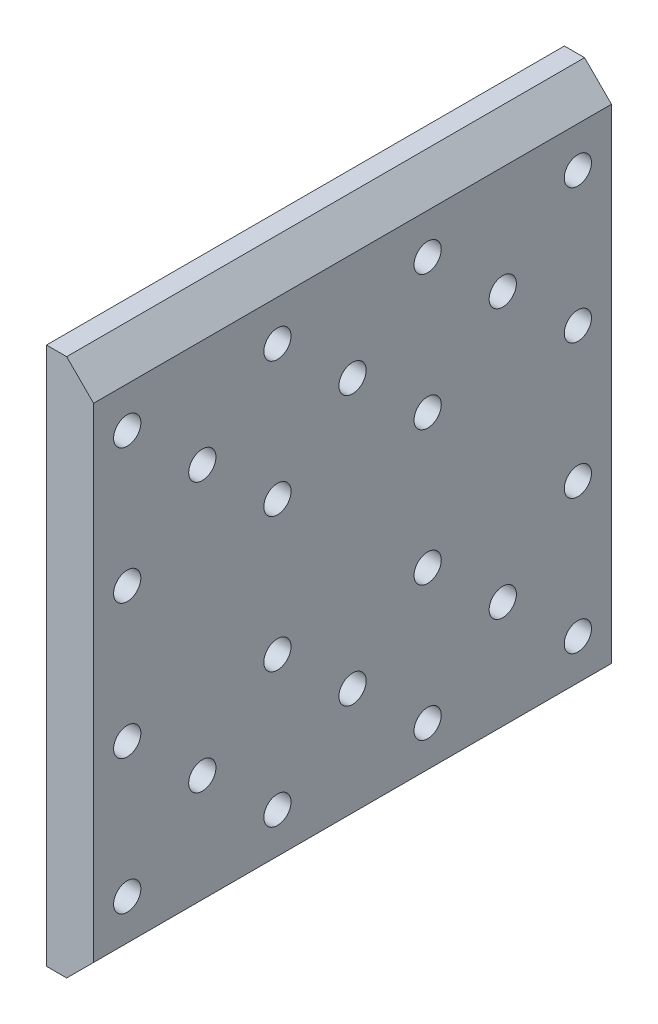
ISO-10303-21;
HEADER;
FILE_DESCRIPTION(('STEP AP214'),'2;1');
FILE_NAME('part.step','',(''),(''),'','','');
FILE_SCHEMA(('AUTOMOTIVE_DESIGN { 1 0 10303 214 1 1 1 1 }'));
ENDSEC;
DATA;
#1=APPLICATION_CONTEXT('core data for automotive mechanical design processes');
#2=APPLICATION_PROTOCOL_DEFINITION('international standard','automotive_design',2000,#1);
#3=PRODUCT_CONTEXT('',#1,'mechanical');
#4=PRODUCT('Part','Part','',(#3));
#5=PRODUCT_RELATED_PRODUCT_CATEGORY('part','',(#4));
#6=PRODUCT_DEFINITION_FORMATION('','',#4);
#7=PRODUCT_DEFINITION_CONTEXT('part definition',#1,'design');
#8=PRODUCT_DEFINITION('design','',#6,#7);
#9=PRODUCT_DEFINITION_SHAPE('','',#8);
#10=(LENGTH_UNIT() NAMED_UNIT(*) SI_UNIT(.MILLI.,.METRE.));
#11=(NAMED_UNIT(*) PLANE_ANGLE_UNIT() SI_UNIT($,.RADIAN.));
#12=(NAMED_UNIT(*) SI_UNIT($,.STERADIAN.) SOLID_ANGLE_UNIT());
#13=UNCERTAINTY_MEASURE_WITH_UNIT(LENGTH_MEASURE(1.E-05),#10,'distance_accuracy_value','');
#14=(GEOMETRIC_REPRESENTATION_CONTEXT(3) GLOBAL_UNCERTAINTY_ASSIGNED_CONTEXT((#13)) GLOBAL_UNIT_ASSIGNED_CONTEXT((#10,
#11,#12)) REPRESENTATION_CONTEXT('',''));
#15=CARTESIAN_POINT('',(0.,0.,0.));
#16=DIRECTION('',(0.,0.,1.));
#17=DIRECTION('',(1.,0.,0.));
#18=AXIS2_PLACEMENT_3D('',#15,#16,#17);
#19=CARTESIAN_POINT('',(6.5,173.75,0.));
#20=DIRECTION('',(-0.707106781186548,0.707106781186547,0.));
#21=DIRECTION('',(0.,0.,1.));
#22=AXIS2_PLACEMENT_3D('',#19,#20,#21);
#23=PLANE('',#22);
#24=DIRECTION('',(-0.707106781186547,-0.707106781186548,0.));
#25=VECTOR('',#24,1.);
#26=CARTESIAN_POINT('',(38.5,205.75,-38.5));
#27=LINE('',#26,#25);
#28=CARTESIAN_POINT('',(10.5,177.75,-38.5));
#29=VERTEX_POINT('',#28);
#30=CARTESIAN_POINT('',(6.5,173.75,-38.5));
#31=VERTEX_POINT('',#30);
#32=EDGE_CURVE('E280',#29,#31,#27,.T.);
#33=ORIENTED_EDGE('',*,*,#32,.F.);
#34=DIRECTION('',(0.,0.,-1.));
#35=VECTOR('',#34,1.);
#36=CARTESIAN_POINT('',(10.5,177.75,0.));
#37=LINE('',#36,#35);
#38=CARTESIAN_POINT('',(10.5,177.75,38.5));
#39=VERTEX_POINT('',#38);
#40=EDGE_CURVE('E386',#39,#29,#37,.T.);
#41=ORIENTED_EDGE('',*,*,#40,.F.);
#42=DIRECTION('',(0.707106781186547,0.707106781186548,0.));
#43=VECTOR('',#42,1.);
#44=CARTESIAN_POINT('',(38.5,205.75,38.5));
#45=LINE('',#44,#43);
#46=CARTESIAN_POINT('',(6.5,173.75,38.5));
#47=VERTEX_POINT('',#46);
#48=EDGE_CURVE('E329',#47,#39,#45,.T.);
#49=ORIENTED_EDGE('',*,*,#48,.F.);
#50=DIRECTION('',(0.,0.,1.));
#51=VECTOR('',#50,1.);
#52=CARTESIAN_POINT('',(6.5,173.75,0.));
#53=LINE('',#52,#51);
#54=EDGE_CURVE('E264',#31,#47,#53,.T.);
#55=ORIENTED_EDGE('',*,*,#54,.F.);
#56=EDGE_LOOP('',(#33,#41,#49,#55));
#57=FACE_BOUND('',#56,.T.);
#58=ADVANCED_FACE('F16',(#57),#23,.F.);
#59=CARTESIAN_POINT('',(10.5,249.75,0.));
#60=DIRECTION('',(0.707106781186548,0.707106781186547,0.));
#61=DIRECTION('',(0.,0.,-1.));
#62=AXIS2_PLACEMENT_3D('',#59,#60,#61);
#63=PLANE('',#62);
#64=DIRECTION('',(0.707106781186547,-0.707106781186548,0.));
#65=VECTOR('',#64,1.);
#66=CARTESIAN_POINT('',(18.5,241.75,-38.5));
#67=LINE('',#66,#65);
#68=CARTESIAN_POINT('',(6.5,253.75,-38.5));
#69=VERTEX_POINT('',#68);
#70=CARTESIAN_POINT('',(10.5,249.75,-38.5));
#71=VERTEX_POINT('',#70);
#72=EDGE_CURVE('E371',#69,#71,#67,.T.);
#73=ORIENTED_EDGE('',*,*,#72,.F.);
#74=DIRECTION('',(0.,0.,-1.));
#75=VECTOR('',#74,1.);
#76=CARTESIAN_POINT('',(6.5,253.75,-38.5));
#77=LINE('',#76,#75);
#78=CARTESIAN_POINT('',(6.5,253.75,38.5));
#79=VERTEX_POINT('',#78);
#80=EDGE_CURVE('E312',#79,#69,#77,.T.);
#81=ORIENTED_EDGE('',*,*,#80,.F.);
#82=DIRECTION('',(-0.707106781186547,0.707106781186548,0.));
#83=VECTOR('',#82,1.);
#84=CARTESIAN_POINT('',(18.5,241.75,38.5));
#85=LINE('',#84,#83);
#86=CARTESIAN_POINT('',(10.5,249.75,38.5));
#87=VERTEX_POINT('',#86);
#88=EDGE_CURVE('E294',#87,#79,#85,.T.);
#89=ORIENTED_EDGE('',*,*,#88,.F.);
#90=DIRECTION('',(0.,0.,1.));
#91=VECTOR('',#90,1.);
#92=CARTESIAN_POINT('',(10.5,249.75,38.5));
#93=LINE('',#92,#91);
#94=EDGE_CURVE('E383',#71,#87,#93,.T.);
#95=ORIENTED_EDGE('',*,*,#94,.F.);
#96=EDGE_LOOP('',(#73,#81,#89,#95));
#97=FACE_BOUND('',#96,.T.);
#98=ADVANCED_FACE('F441',(#97),#63,.T.);
#99=CARTESIAN_POINT('',(-502.267801013305,233.75,-22.3333333333334));
#100=DIRECTION('',(1.,0.,0.));
#101=DIRECTION('',(0.,0.,-1.));
#102=AXIS2_PLACEMENT_3D('',#99,#100,#101);
#103=CYLINDRICAL_SURFACE('',#102,2.025);
#104=CARTESIAN_POINT('',(3.49999999999995,233.75,-22.3333333333334));
#105=DIRECTION('',(1.,0.,0.));
#106=DIRECTION('',(0.,0.,-1.));
#107=AXIS2_PLACEMENT_3D('',#104,#105,#106);
#108=CIRCLE('',#107,2.025);
#109=CARTESIAN_POINT('',(3.49999999999995,233.75,-24.3583333333334));
#110=VERTEX_POINT('',#109);
#111=EDGE_CURVE('E546',#110,#110,#108,.T.);
#112=ORIENTED_EDGE('',*,*,#111,.F.);
#113=EDGE_LOOP('',(#112));
#114=FACE_BOUND('',#113,.T.);
#115=CARTESIAN_POINT('',(10.5,233.75,-22.3333333333334));
#116=DIRECTION('',(1.,0.,0.));
#117=DIRECTION('',(0.,0.,-1.));
#118=AXIS2_PLACEMENT_3D('',#115,#116,#117);
#119=CIRCLE('',#118,2.025);
#120=CARTESIAN_POINT('',(10.5,233.75,-24.3583333333334));
#121=VERTEX_POINT('',#120);
#122=EDGE_CURVE('E263',#121,#121,#119,.T.);
#123=ORIENTED_EDGE('',*,*,#122,.T.);
#124=EDGE_LOOP('',(#123));
#125=FACE_BOUND('',#124,.T.);
#126=ADVANCED_FACE('F18',(#114,#125),#103,.F.);
#127=CARTESIAN_POINT('',(-502.267801013305,203.75,-11.1666666666667));
#128=DIRECTION('',(1.,0.,0.));
#129=DIRECTION('',(0.,0.,-1.));
#130=AXIS2_PLACEMENT_3D('',#127,#128,#129);
#131=CYLINDRICAL_SURFACE('',#130,2.025);
#132=CARTESIAN_POINT('',(3.49999999999995,203.75,-11.1666666666667));
#133=DIRECTION('',(1.,0.,0.));
#134=DIRECTION('',(0.,0.,-1.));
#135=AXIS2_PLACEMENT_3D('',#132,#133,#134);
#136=CIRCLE('',#135,2.025);
#137=CARTESIAN_POINT('',(3.49999999999995,203.75,-13.1916666666667));
#138=VERTEX_POINT('',#137);
#139=EDGE_CURVE('E326',#138,#138,#136,.T.);
#140=ORIENTED_EDGE('',*,*,#139,.F.);
#141=EDGE_LOOP('',(#140));
#142=FACE_BOUND('',#141,.T.);
#143=CARTESIAN_POINT('',(10.5,203.75,-11.1666666666667));
#144=DIRECTION('',(1.,0.,0.));
#145=DIRECTION('',(0.,0.,-1.));
#146=AXIS2_PLACEMENT_3D('',#143,#144,#145);
#147=CIRCLE('',#146,2.025);
#148=CARTESIAN_POINT('',(10.5,203.75,-13.1916666666667));
#149=VERTEX_POINT('',#148);
#150=EDGE_CURVE('E315',#149,#149,#147,.T.);
#151=ORIENTED_EDGE('',*,*,#150,.T.);
#152=EDGE_LOOP('',(#151));
#153=FACE_BOUND('',#152,.T.);
#154=ADVANCED_FACE('F440',(#142,#153),#131,.F.);
#155=CARTESIAN_POINT('',(-502.267801013305,223.75,-11.1666666666667));
#156=DIRECTION('',(1.,0.,0.));
#157=DIRECTION('',(0.,0.,-1.));
#158=AXIS2_PLACEMENT_3D('',#155,#156,#157);
#159=CYLINDRICAL_SURFACE('',#158,2.025);
#160=CARTESIAN_POINT('',(3.49999999999995,223.75,-11.1666666666667));
#161=DIRECTION('',(1.,0.,0.));
#162=DIRECTION('',(0.,0.,-1.));
#163=AXIS2_PLACEMENT_3D('',#160,#161,#162);
#164=CIRCLE('',#163,2.025);
#165=CARTESIAN_POINT('',(3.49999999999995,223.75,-13.1916666666667));
#166=VERTEX_POINT('',#165);
#167=EDGE_CURVE('E322',#166,#166,#164,.T.);
#168=ORIENTED_EDGE('',*,*,#167,.F.);
#169=EDGE_LOOP('',(#168));
#170=FACE_BOUND('',#169,.T.);
#171=CARTESIAN_POINT('',(10.5,223.75,-11.1666666666667));
#172=DIRECTION('',(1.,0.,0.));
#173=DIRECTION('',(0.,0.,-1.));
#174=AXIS2_PLACEMENT_3D('',#171,#172,#173);
#175=CIRCLE('',#174,2.025);
#176=CARTESIAN_POINT('',(10.5,223.75,-13.1916666666667));
#177=VERTEX_POINT('',#176);
#178=EDGE_CURVE('E303',#177,#177,#175,.T.);
#179=ORIENTED_EDGE('',*,*,#178,.T.);
#180=EDGE_LOOP('',(#179));
#181=FACE_BOUND('',#180,.T.);
#182=ADVANCED_FACE('F448',(#170,#181),#159,.F.);
#183=CARTESIAN_POINT('',(-502.267801013305,243.75,11.1666666666667));
#184=DIRECTION('',(1.,0.,0.));
#185=DIRECTION('',(0.,0.,-1.));
#186=AXIS2_PLACEMENT_3D('',#183,#184,#185);
#187=CYLINDRICAL_SURFACE('',#186,2.025);
#188=CARTESIAN_POINT('',(3.49999999999995,243.75,11.1666666666667));
#189=DIRECTION('',(1.,0.,0.));
#190=DIRECTION('',(0.,0.,-1.));
#191=AXIS2_PLACEMENT_3D('',#188,#189,#190);
#192=CIRCLE('',#191,2.025);
#193=CARTESIAN_POINT('',(3.49999999999995,243.75,9.14166666666666));
#194=VERTEX_POINT('',#193);
#195=EDGE_CURVE('E325',#194,#194,#192,.T.);
#196=ORIENTED_EDGE('',*,*,#195,.F.);
#197=EDGE_LOOP('',(#196));
#198=FACE_BOUND('',#197,.T.);
#199=CARTESIAN_POINT('',(10.5,243.75,11.1666666666667));
#200=DIRECTION('',(1.,0.,0.));
#201=DIRECTION('',(0.,0.,-1.));
#202=AXIS2_PLACEMENT_3D('',#199,#200,#201);
#203=CIRCLE('',#202,2.025);
#204=CARTESIAN_POINT('',(10.5,243.75,9.14166666666666));
#205=VERTEX_POINT('',#204);
#206=EDGE_CURVE('E299',#205,#205,#203,.T.);
#207=ORIENTED_EDGE('',*,*,#206,.T.);
#208=EDGE_LOOP('',(#207));
#209=FACE_BOUND('',#208,.T.);
#210=ADVANCED_FACE('F469',(#198,#209),#187,.F.);
#211=CARTESIAN_POINT('',(-502.267801013305,183.75,11.1666666666667));
#212=DIRECTION('',(1.,0.,0.));
#213=DIRECTION('',(0.,0.,-1.));
#214=AXIS2_PLACEMENT_3D('',#211,#212,#213);
#215=CYLINDRICAL_SURFACE('',#214,2.025);
#216=CARTESIAN_POINT('',(3.49999999999995,183.75,11.1666666666667));
#217=DIRECTION('',(1.,0.,0.));
#218=DIRECTION('',(0.,0.,-1.));
#219=AXIS2_PLACEMENT_3D('',#216,#217,#218);
#220=CIRCLE('',#219,2.025);
#221=CARTESIAN_POINT('',(3.49999999999995,183.75,9.14166666666666));
#222=VERTEX_POINT('',#221);
#223=EDGE_CURVE('E561',#222,#222,#220,.T.);
#224=ORIENTED_EDGE('',*,*,#223,.F.);
#225=EDGE_LOOP('',(#224));
#226=FACE_BOUND('',#225,.T.);
#227=CARTESIAN_POINT('',(10.5,183.75,11.1666666666667));
#228=DIRECTION('',(1.,0.,0.));
#229=DIRECTION('',(0.,0.,-1.));
#230=AXIS2_PLACEMENT_3D('',#227,#228,#229);
#231=CIRCLE('',#230,2.025);
#232=CARTESIAN_POINT('',(10.5,183.75,9.14166666666666));
#233=VERTEX_POINT('',#232);
#234=EDGE_CURVE('E302',#233,#233,#231,.T.);
#235=ORIENTED_EDGE('',*,*,#234,.T.);
#236=EDGE_LOOP('',(#235));
#237=FACE_BOUND('',#236,.T.);
#238=ADVANCED_FACE('F495',(#226,#237),#215,.F.);
#239=CARTESIAN_POINT('',(-502.267801013305,233.75,0.));
#240=DIRECTION('',(1.,0.,0.));
#241=DIRECTION('',(0.,0.,-1.));
#242=AXIS2_PLACEMENT_3D('',#239,#240,#241);
#243=CYLINDRICAL_SURFACE('',#242,2.025);
#244=CARTESIAN_POINT('',(3.49999999999995,233.75,0.));
#245=DIRECTION('',(1.,0.,0.));
#246=DIRECTION('',(0.,0.,-1.));
#247=AXIS2_PLACEMENT_3D('',#244,#245,#246);
#248=CIRCLE('',#247,2.025);
#249=CARTESIAN_POINT('',(3.49999999999995,233.75,-2.025));
#250=VERTEX_POINT('',#249);
#251=EDGE_CURVE('E292',#250,#250,#248,.T.);
#252=ORIENTED_EDGE('',*,*,#251,.F.);
#253=EDGE_LOOP('',(#252));
#254=FACE_BOUND('',#253,.T.);
#255=CARTESIAN_POINT('',(10.5,233.75,0.));
#256=DIRECTION('',(1.,0.,0.));
#257=DIRECTION('',(0.,0.,-1.));
#258=AXIS2_PLACEMENT_3D('',#255,#256,#257);
#259=CIRCLE('',#258,2.025);
#260=CARTESIAN_POINT('',(10.5,233.75,-2.025));
#261=VERTEX_POINT('',#260);
#262=EDGE_CURVE('E427',#261,#261,#259,.T.);
#263=ORIENTED_EDGE('',*,*,#262,.T.);
#264=EDGE_LOOP('',(#263));
#265=FACE_BOUND('',#264,.T.);
#266=ADVANCED_FACE('F491',(#254,#265),#243,.F.);
#267=CARTESIAN_POINT('',(-502.267801013305,223.75,-33.5));
#268=DIRECTION('',(1.,0.,0.));
#269=DIRECTION('',(0.,0.,-1.));
#270=AXIS2_PLACEMENT_3D('',#267,#268,#269);
#271=CYLINDRICAL_SURFACE('',#270,2.025);
#272=CARTESIAN_POINT('',(3.49999999999995,223.75,-33.5));
#273=DIRECTION('',(1.,0.,0.));
#274=DIRECTION('',(0.,0.,-1.));
#275=AXIS2_PLACEMENT_3D('',#272,#273,#274);
#276=CIRCLE('',#275,2.025);
#277=CARTESIAN_POINT('',(3.49999999999995,223.75,-35.525));
#278=VERTEX_POINT('',#277);
#279=EDGE_CURVE('E318',#278,#278,#276,.T.);
#280=ORIENTED_EDGE('',*,*,#279,.F.);
#281=EDGE_LOOP('',(#280));
#282=FACE_BOUND('',#281,.T.);
#283=CARTESIAN_POINT('',(10.5,223.75,-33.5));
#284=DIRECTION('',(1.,0.,0.));
#285=DIRECTION('',(0.,0.,-1.));
#286=AXIS2_PLACEMENT_3D('',#283,#284,#285);
#287=CIRCLE('',#286,2.025);
#288=CARTESIAN_POINT('',(10.5,223.75,-35.525));
#289=VERTEX_POINT('',#288);
#290=EDGE_CURVE('E424',#289,#289,#287,.T.);
#291=ORIENTED_EDGE('',*,*,#290,.T.);
#292=EDGE_LOOP('',(#291));
#293=FACE_BOUND('',#292,.T.);
#294=ADVANCED_FACE('F494',(#282,#293),#271,.F.);
#295=CARTESIAN_POINT('',(-502.267801013305,193.75,-22.3333333333334));
#296=DIRECTION('',(1.,0.,0.));
#297=DIRECTION('',(0.,0.,-1.));
#298=AXIS2_PLACEMENT_3D('',#295,#296,#297);
#299=CYLINDRICAL_SURFACE('',#298,2.025);
#300=CARTESIAN_POINT('',(3.49999999999995,193.75,-22.3333333333334));
#301=DIRECTION('',(1.,0.,0.));
#302=DIRECTION('',(0.,0.,-1.));
#303=AXIS2_PLACEMENT_3D('',#300,#301,#302);
#304=CIRCLE('',#303,2.025);
#305=CARTESIAN_POINT('',(3.49999999999995,193.75,-24.3583333333334));
#306=VERTEX_POINT('',#305);
#307=EDGE_CURVE('E321',#306,#306,#304,.T.);
#308=ORIENTED_EDGE('',*,*,#307,.F.);
#309=EDGE_LOOP('',(#308));
#310=FACE_BOUND('',#309,.T.);
#311=CARTESIAN_POINT('',(10.5,193.75,-22.3333333333334));
#312=DIRECTION('',(1.,0.,0.));
#313=DIRECTION('',(0.,0.,-1.));
#314=AXIS2_PLACEMENT_3D('',#311,#312,#313);
#315=CIRCLE('',#314,2.025);
#316=CARTESIAN_POINT('',(10.5,193.75,-24.3583333333334));
#317=VERTEX_POINT('',#316);
#318=EDGE_CURVE('E338',#317,#317,#315,.T.);
#319=ORIENTED_EDGE('',*,*,#318,.T.);
#320=EDGE_LOOP('',(#319));
#321=FACE_BOUND('',#320,.T.);
#322=ADVANCED_FACE('F515',(#310,#321),#299,.F.);
#323=CARTESIAN_POINT('',(-502.267801013305,223.75,33.5));
#324=DIRECTION('',(1.,0.,0.));
#325=DIRECTION('',(0.,0.,-1.));
#326=AXIS2_PLACEMENT_3D('',#323,#324,#325);
#327=CYLINDRICAL_SURFACE('',#326,2.025);
#328=CARTESIAN_POINT('',(3.49999999999995,223.75,33.5));
#329=DIRECTION('',(1.,0.,0.));
#330=DIRECTION('',(0.,0.,-1.));
#331=AXIS2_PLACEMENT_3D('',#328,#329,#330);
#332=CIRCLE('',#331,2.025);
#333=CARTESIAN_POINT('',(3.49999999999995,223.75,31.475));
#334=VERTEX_POINT('',#333);
#335=EDGE_CURVE('E393',#334,#334,#332,.T.);
#336=ORIENTED_EDGE('',*,*,#335,.F.);
#337=EDGE_LOOP('',(#336));
#338=FACE_BOUND('',#337,.T.);
#339=CARTESIAN_POINT('',(10.5,223.75,33.5));
#340=DIRECTION('',(1.,0.,0.));
#341=DIRECTION('',(0.,0.,-1.));
#342=AXIS2_PLACEMENT_3D('',#339,#340,#341);
#343=CIRCLE('',#342,2.025);
#344=CARTESIAN_POINT('',(10.5,223.75,31.475));
#345=VERTEX_POINT('',#344);
#346=EDGE_CURVE('E334',#345,#345,#343,.T.);
#347=ORIENTED_EDGE('',*,*,#346,.T.);
#348=EDGE_LOOP('',(#347));
#349=FACE_BOUND('',#348,.T.);
#350=ADVANCED_FACE('F509',(#338,#349),#327,.F.);
#351=CARTESIAN_POINT('',(-502.267801013305,193.75,22.3333333333334));
#352=DIRECTION('',(1.,0.,0.));
#353=DIRECTION('',(0.,0.,-1.));
#354=AXIS2_PLACEMENT_3D('',#351,#352,#353);
#355=CYLINDRICAL_SURFACE('',#354,2.025);
#356=CARTESIAN_POINT('',(3.49999999999995,193.75,22.3333333333334));
#357=DIRECTION('',(1.,0.,0.));
#358=DIRECTION('',(0.,0.,-1.));
#359=AXIS2_PLACEMENT_3D('',#356,#357,#358);
#360=CIRCLE('',#359,2.025);
#361=CARTESIAN_POINT('',(3.49999999999995,193.75,20.3083333333334));
#362=VERTEX_POINT('',#361);
#363=EDGE_CURVE('E366',#362,#362,#360,.T.);
#364=ORIENTED_EDGE('',*,*,#363,.F.);
#365=EDGE_LOOP('',(#364));
#366=FACE_BOUND('',#365,.T.);
#367=CARTESIAN_POINT('',(10.5,193.75,22.3333333333334));
#368=DIRECTION('',(1.,0.,0.));
#369=DIRECTION('',(0.,0.,-1.));
#370=AXIS2_PLACEMENT_3D('',#367,#368,#369);
#371=CIRCLE('',#370,2.025);
#372=CARTESIAN_POINT('',(10.5,193.75,20.3083333333334));
#373=VERTEX_POINT('',#372);
#374=EDGE_CURVE('E337',#373,#373,#371,.T.);
#375=ORIENTED_EDGE('',*,*,#374,.T.);
#376=EDGE_LOOP('',(#375));
#377=FACE_BOUND('',#376,.T.);
#378=ADVANCED_FACE('F506',(#366,#377),#355,.F.);
#379=CARTESIAN_POINT('',(-502.267801013305,243.75,-33.5));
#380=DIRECTION('',(1.,0.,0.));
#381=DIRECTION('',(0.,0.,-1.));
#382=AXIS2_PLACEMENT_3D('',#379,#380,#381);
#383=CYLINDRICAL_SURFACE('',#382,2.025);
#384=CARTESIAN_POINT('',(3.49999999999995,243.75,-33.5));
#385=DIRECTION('',(1.,0.,0.));
#386=DIRECTION('',(0.,0.,-1.));
#387=AXIS2_PLACEMENT_3D('',#384,#385,#386);
#388=CIRCLE('',#387,2.025);
#389=CARTESIAN_POINT('',(3.49999999999995,243.75,-35.525));
#390=VERTEX_POINT('',#389);
#391=EDGE_CURVE('E363',#390,#390,#388,.T.);
#392=ORIENTED_EDGE('',*,*,#391,.F.);
#393=EDGE_LOOP('',(#392));
#394=FACE_BOUND('',#393,.T.);
#395=CARTESIAN_POINT('',(10.5,243.75,-33.5));
#396=DIRECTION('',(1.,0.,0.));
#397=DIRECTION('',(0.,0.,-1.));
#398=AXIS2_PLACEMENT_3D('',#395,#396,#397);
#399=CIRCLE('',#398,2.025);
#400=CARTESIAN_POINT('',(10.5,243.75,-35.525));
#401=VERTEX_POINT('',#400);
#402=EDGE_CURVE('E347',#401,#401,#399,.T.);
#403=ORIENTED_EDGE('',*,*,#402,.T.);
#404=EDGE_LOOP('',(#403));
#405=FACE_BOUND('',#404,.T.);
#406=ADVANCED_FACE('F405',(#394,#405),#383,.F.);
#407=CARTESIAN_POINT('',(-502.267801013305,203.75,11.1666666666667));
#408=DIRECTION('',(1.,0.,0.));
#409=DIRECTION('',(0.,0.,-1.));
#410=AXIS2_PLACEMENT_3D('',#407,#408,#409);
#411=CYLINDRICAL_SURFACE('',#410,2.025);
#412=CARTESIAN_POINT('',(3.49999999999995,203.75,11.1666666666667));
#413=DIRECTION('',(1.,0.,0.));
#414=DIRECTION('',(0.,0.,-1.));
#415=AXIS2_PLACEMENT_3D('',#412,#413,#414);
#416=CIRCLE('',#415,2.025);
#417=CARTESIAN_POINT('',(3.49999999999995,203.75,9.14166666666666));
#418=VERTEX_POINT('',#417);
#419=EDGE_CURVE('E333',#418,#418,#416,.T.);
#420=ORIENTED_EDGE('',*,*,#419,.F.);
#421=EDGE_LOOP('',(#420));
#422=FACE_BOUND('',#421,.T.);
#423=CARTESIAN_POINT('',(10.5,203.75,11.1666666666667));
#424=DIRECTION('',(1.,0.,0.));
#425=DIRECTION('',(0.,0.,-1.));
#426=AXIS2_PLACEMENT_3D('',#423,#424,#425);
#427=CIRCLE('',#426,2.025);
#428=CARTESIAN_POINT('',(10.5,203.75,9.14166666666666));
#429=VERTEX_POINT('',#428);
#430=EDGE_CURVE('E342',#429,#429,#427,.T.);
#431=ORIENTED_EDGE('',*,*,#430,.T.);
#432=EDGE_LOOP('',(#431));
#433=FACE_BOUND('',#432,.T.);
#434=ADVANCED_FACE('F401',(#422,#433),#411,.F.);
#435=CARTESIAN_POINT('',(-502.267801013305,233.75,22.3333333333334));
#436=DIRECTION('',(1.,0.,0.));
#437=DIRECTION('',(0.,0.,-1.));
#438=AXIS2_PLACEMENT_3D('',#435,#436,#437);
#439=CYLINDRICAL_SURFACE('',#438,2.025);
#440=CARTESIAN_POINT('',(3.49999999999995,233.75,22.3333333333334));
#441=DIRECTION('',(1.,0.,0.));
#442=DIRECTION('',(0.,0.,-1.));
#443=AXIS2_PLACEMENT_3D('',#440,#441,#442);
#444=CIRCLE('',#443,2.025);
#445=CARTESIAN_POINT('',(3.49999999999995,233.75,20.3083333333334));
#446=VERTEX_POINT('',#445);
#447=EDGE_CURVE('E330',#446,#446,#444,.T.);
#448=ORIENTED_EDGE('',*,*,#447,.F.);
#449=EDGE_LOOP('',(#448));
#450=FACE_BOUND('',#449,.T.);
#451=CARTESIAN_POINT('',(10.5,233.75,22.3333333333334));
#452=DIRECTION('',(1.,0.,0.));
#453=DIRECTION('',(0.,0.,-1.));
#454=AXIS2_PLACEMENT_3D('',#451,#452,#453);
#455=CIRCLE('',#454,2.025);
#456=CARTESIAN_POINT('',(10.5,233.75,20.3083333333334));
#457=VERTEX_POINT('',#456);
#458=EDGE_CURVE('E346',#457,#457,#455,.T.);
#459=ORIENTED_EDGE('',*,*,#458,.T.);
#460=EDGE_LOOP('',(#459));
#461=FACE_BOUND('',#460,.T.);
#462=ADVANCED_FACE('F404',(#450,#461),#439,.F.);
#463=CARTESIAN_POINT('',(-502.267801013305,203.75,33.5));
#464=DIRECTION('',(1.,0.,0.));
#465=DIRECTION('',(0.,0.,-1.));
#466=AXIS2_PLACEMENT_3D('',#463,#464,#465);
#467=CYLINDRICAL_SURFACE('',#466,2.025);
#468=CARTESIAN_POINT('',(3.49999999999995,203.75,33.5));
#469=DIRECTION('',(1.,0.,0.));
#470=DIRECTION('',(0.,0.,-1.));
#471=AXIS2_PLACEMENT_3D('',#468,#469,#470);
#472=CIRCLE('',#471,2.025);
#473=CARTESIAN_POINT('',(3.49999999999995,203.75,31.475));
#474=VERTEX_POINT('',#473);
#475=EDGE_CURVE('E20',#474,#474,#472,.T.);
#476=ORIENTED_EDGE('',*,*,#475,.F.);
#477=EDGE_LOOP('',(#476));
#478=FACE_BOUND('',#477,.T.);
#479=CARTESIAN_POINT('',(10.5,203.75,33.5));
#480=DIRECTION('',(1.,0.,0.));
#481=DIRECTION('',(0.,0.,-1.));
#482=AXIS2_PLACEMENT_3D('',#479,#480,#481);
#483=CIRCLE('',#482,2.025);
#484=CARTESIAN_POINT('',(10.5,203.75,31.475));
#485=VERTEX_POINT('',#484);
#486=EDGE_CURVE('E351',#485,#485,#483,.T.);
#487=ORIENTED_EDGE('',*,*,#486,.T.);
#488=EDGE_LOOP('',(#487));
#489=FACE_BOUND('',#488,.T.);
#490=ADVANCED_FACE('F477',(#478,#489),#467,.F.);
#491=CARTESIAN_POINT('',(-502.267801013305,183.75,33.5));
#492=DIRECTION('',(1.,0.,0.));
#493=DIRECTION('',(0.,0.,-1.));
#494=AXIS2_PLACEMENT_3D('',#491,#492,#493);
#495=CYLINDRICAL_SURFACE('',#494,2.025);
#496=CARTESIAN_POINT('',(3.49999999999995,183.75,33.5));
#497=DIRECTION('',(1.,0.,0.));
#498=DIRECTION('',(0.,0.,-1.));
#499=AXIS2_PLACEMENT_3D('',#496,#497,#498);
#500=CIRCLE('',#499,2.025);
#501=CARTESIAN_POINT('',(3.49999999999995,183.75,31.475));
#502=VERTEX_POINT('',#501);
#503=EDGE_CURVE('E213',#502,#502,#500,.T.);
#504=ORIENTED_EDGE('',*,*,#503,.F.);
#505=EDGE_LOOP('',(#504));
#506=FACE_BOUND('',#505,.T.);
#507=CARTESIAN_POINT('',(10.5,183.75,33.5));
#508=DIRECTION('',(1.,0.,0.));
#509=DIRECTION('',(0.,0.,-1.));
#510=AXIS2_PLACEMENT_3D('',#507,#508,#509);
#511=CIRCLE('',#510,2.025);
#512=CARTESIAN_POINT('',(10.5,183.75,31.475));
#513=VERTEX_POINT('',#512);
#514=EDGE_CURVE('E348',#513,#513,#511,.T.);
#515=ORIENTED_EDGE('',*,*,#514,.T.);
#516=EDGE_LOOP('',(#515));
#517=FACE_BOUND('',#516,.T.);
#518=ADVANCED_FACE('F479',(#506,#517),#495,.F.);
#519=CARTESIAN_POINT('',(-502.267801013305,243.75,-11.1666666666667));
#520=DIRECTION('',(1.,0.,0.));
#521=DIRECTION('',(0.,0.,-1.));
#522=AXIS2_PLACEMENT_3D('',#519,#520,#521);
#523=CYLINDRICAL_SURFACE('',#522,2.025);
#524=CARTESIAN_POINT('',(3.49999999999995,243.75,-11.1666666666667));
#525=DIRECTION('',(1.,0.,0.));
#526=DIRECTION('',(0.,0.,-1.));
#527=AXIS2_PLACEMENT_3D('',#524,#525,#526);
#528=CIRCLE('',#527,2.025);
#529=CARTESIAN_POINT('',(3.49999999999995,243.75,-13.1916666666667));
#530=VERTEX_POINT('',#529);
#531=EDGE_CURVE('E222',#530,#530,#528,.T.);
#532=ORIENTED_EDGE('',*,*,#531,.F.);
#533=EDGE_LOOP('',(#532));
#534=FACE_BOUND('',#533,.T.);
#535=CARTESIAN_POINT('',(10.5,243.75,-11.1666666666667));
#536=DIRECTION('',(1.,0.,0.));
#537=DIRECTION('',(0.,0.,-1.));
#538=AXIS2_PLACEMENT_3D('',#535,#536,#537);
#539=CIRCLE('',#538,2.025);
#540=CARTESIAN_POINT('',(10.5,243.75,-13.1916666666667));
#541=VERTEX_POINT('',#540);
#542=EDGE_CURVE('E308',#541,#541,#539,.T.);
#543=ORIENTED_EDGE('',*,*,#542,.T.);
#544=EDGE_LOOP('',(#543));
#545=FACE_BOUND('',#544,.T.);
#546=ADVANCED_FACE('F465',(#534,#545),#523,.F.);
#547=CARTESIAN_POINT('',(-502.267801013305,183.75,-11.1666666666667));
#548=DIRECTION('',(1.,0.,0.));
#549=DIRECTION('',(0.,0.,-1.));
#550=AXIS2_PLACEMENT_3D('',#547,#548,#549);
#551=CYLINDRICAL_SURFACE('',#550,2.025);
#552=CARTESIAN_POINT('',(3.49999999999995,183.75,-11.1666666666667));
#553=DIRECTION('',(1.,0.,0.));
#554=DIRECTION('',(0.,0.,-1.));
#555=AXIS2_PLACEMENT_3D('',#552,#553,#554);
#556=CIRCLE('',#555,2.025);
#557=CARTESIAN_POINT('',(3.49999999999995,183.75,-13.1916666666667));
#558=VERTEX_POINT('',#557);
#559=EDGE_CURVE('E359',#558,#558,#556,.T.);
#560=ORIENTED_EDGE('',*,*,#559,.F.);
#561=EDGE_LOOP('',(#560));
#562=FACE_BOUND('',#561,.T.);
#563=CARTESIAN_POINT('',(10.5,183.75,-11.1666666666667));
#564=DIRECTION('',(1.,0.,0.));
#565=DIRECTION('',(0.,0.,-1.));
#566=AXIS2_PLACEMENT_3D('',#563,#564,#565);
#567=CIRCLE('',#566,2.025);
#568=CARTESIAN_POINT('',(10.5,183.75,-13.1916666666667));
#569=VERTEX_POINT('',#568);
#570=EDGE_CURVE('E304',#569,#569,#567,.T.);
#571=ORIENTED_EDGE('',*,*,#570,.T.);
#572=EDGE_LOOP('',(#571));
#573=FACE_BOUND('',#572,.T.);
#574=ADVANCED_FACE('F461',(#562,#573),#551,.F.);
#575=CARTESIAN_POINT('',(-502.267801013305,193.75,0.));
#576=DIRECTION('',(1.,0.,0.));
#577=DIRECTION('',(0.,0.,-1.));
#578=AXIS2_PLACEMENT_3D('',#575,#576,#577);
#579=CYLINDRICAL_SURFACE('',#578,2.025);
#580=CARTESIAN_POINT('',(3.49999999999995,193.75,0.));
#581=DIRECTION('',(1.,0.,0.));
#582=DIRECTION('',(0.,0.,-1.));
#583=AXIS2_PLACEMENT_3D('',#580,#581,#582);
#584=CIRCLE('',#583,2.025);
#585=CARTESIAN_POINT('',(3.49999999999995,193.75,-2.025));
#586=VERTEX_POINT('',#585);
#587=EDGE_CURVE('E355',#586,#586,#584,.T.);
#588=ORIENTED_EDGE('',*,*,#587,.F.);
#589=EDGE_LOOP('',(#588));
#590=FACE_BOUND('',#589,.T.);
#591=CARTESIAN_POINT('',(10.5,193.75,0.));
#592=DIRECTION('',(1.,0.,0.));
#593=DIRECTION('',(0.,0.,-1.));
#594=AXIS2_PLACEMENT_3D('',#591,#592,#593);
#595=CIRCLE('',#594,2.025);
#596=CARTESIAN_POINT('',(10.5,193.75,-2.025));
#597=VERTEX_POINT('',#596);
#598=EDGE_CURVE('E307',#597,#597,#595,.T.);
#599=ORIENTED_EDGE('',*,*,#598,.T.);
#600=EDGE_LOOP('',(#599));
#601=FACE_BOUND('',#600,.T.);
#602=ADVANCED_FACE('F464',(#590,#601),#579,.F.);
#603=CARTESIAN_POINT('',(-502.267801013305,223.75,11.1666666666667));
#604=DIRECTION('',(1.,0.,0.));
#605=DIRECTION('',(0.,0.,-1.));
#606=AXIS2_PLACEMENT_3D('',#603,#604,#605);
#607=CYLINDRICAL_SURFACE('',#606,2.025);
#608=CARTESIAN_POINT('',(3.49999999999995,223.75,11.1666666666667));
#609=DIRECTION('',(1.,0.,0.));
#610=DIRECTION('',(0.,0.,-1.));
#611=AXIS2_PLACEMENT_3D('',#608,#609,#610);
#612=CIRCLE('',#611,2.025);
#613=CARTESIAN_POINT('',(3.49999999999995,223.75,9.14166666666666));
#614=VERTEX_POINT('',#613);
#615=EDGE_CURVE('E358',#614,#614,#612,.T.);
#616=ORIENTED_EDGE('',*,*,#615,.F.);
#617=EDGE_LOOP('',(#616));
#618=FACE_BOUND('',#617,.T.);
#619=CARTESIAN_POINT('',(10.5,223.75,11.1666666666667));
#620=DIRECTION('',(1.,0.,0.));
#621=DIRECTION('',(0.,0.,-1.));
#622=AXIS2_PLACEMENT_3D('',#619,#620,#621);
#623=CIRCLE('',#622,2.025);
#624=CARTESIAN_POINT('',(10.5,223.75,9.14166666666666));
#625=VERTEX_POINT('',#624);
#626=EDGE_CURVE('E354',#625,#625,#623,.T.);
#627=ORIENTED_EDGE('',*,*,#626,.T.);
#628=EDGE_LOOP('',(#627));
#629=FACE_BOUND('',#628,.T.);
#630=ADVANCED_FACE('F473',(#618,#629),#607,.F.);
#631=CARTESIAN_POINT('',(-502.267801013305,183.75,-33.5));
#632=DIRECTION('',(1.,0.,0.));
#633=DIRECTION('',(0.,0.,-1.));
#634=AXIS2_PLACEMENT_3D('',#631,#632,#633);
#635=CYLINDRICAL_SURFACE('',#634,2.025);
#636=CARTESIAN_POINT('',(3.49999999999995,183.75,-33.5));
#637=DIRECTION('',(1.,0.,0.));
#638=DIRECTION('',(0.,0.,-1.));
#639=AXIS2_PLACEMENT_3D('',#636,#637,#638);
#640=CIRCLE('',#639,2.025);
#641=CARTESIAN_POINT('',(3.49999999999995,183.75,-35.525));
#642=VERTEX_POINT('',#641);
#643=EDGE_CURVE('E535',#642,#642,#640,.T.);
#644=ORIENTED_EDGE('',*,*,#643,.F.);
#645=EDGE_LOOP('',(#644));
#646=FACE_BOUND('',#645,.T.);
#647=CARTESIAN_POINT('',(10.5,183.75,-33.5));
#648=DIRECTION('',(1.,0.,0.));
#649=DIRECTION('',(0.,0.,-1.));
#650=AXIS2_PLACEMENT_3D('',#647,#648,#649);
#651=CIRCLE('',#650,2.025);
#652=CARTESIAN_POINT('',(10.5,183.75,-35.525));
#653=VERTEX_POINT('',#652);
#654=EDGE_CURVE('E382',#653,#653,#651,.T.);
#655=ORIENTED_EDGE('',*,*,#654,.T.);
#656=EDGE_LOOP('',(#655));
#657=FACE_BOUND('',#656,.T.);
#658=ADVANCED_FACE('F522',(#646,#657),#635,.F.);
#659=CARTESIAN_POINT('',(-502.267801013305,203.75,-33.5));
#660=DIRECTION('',(1.,0.,0.));
#661=DIRECTION('',(0.,0.,-1.));
#662=AXIS2_PLACEMENT_3D('',#659,#660,#661);
#663=CYLINDRICAL_SURFACE('',#662,2.025);
#664=CARTESIAN_POINT('',(3.49999999999995,203.75,-33.5));
#665=DIRECTION('',(1.,0.,0.));
#666=DIRECTION('',(0.,0.,-1.));
#667=AXIS2_PLACEMENT_3D('',#664,#665,#666);
#668=CIRCLE('',#667,2.025);
#669=CARTESIAN_POINT('',(3.49999999999995,203.75,-35.525));
#670=VERTEX_POINT('',#669);
#671=EDGE_CURVE('E27',#670,#670,#668,.T.);
#672=ORIENTED_EDGE('',*,*,#671,.F.);
#673=EDGE_LOOP('',(#672));
#674=FACE_BOUND('',#673,.T.);
#675=CARTESIAN_POINT('',(10.5,203.75,-33.5));
#676=DIRECTION('',(1.,0.,0.));
#677=DIRECTION('',(0.,0.,-1.));
#678=AXIS2_PLACEMENT_3D('',#675,#676,#677);
#679=CIRCLE('',#678,2.025);
#680=CARTESIAN_POINT('',(10.5,203.75,-35.525));
#681=VERTEX_POINT('',#680);
#682=EDGE_CURVE('E377',#681,#681,#679,.T.);
#683=ORIENTED_EDGE('',*,*,#682,.T.);
#684=EDGE_LOOP('',(#683));
#685=FACE_BOUND('',#684,.T.);
#686=ADVANCED_FACE('F488',(#674,#685),#663,.F.);
#687=CARTESIAN_POINT('',(-502.267801013305,243.75,33.5));
#688=DIRECTION('',(1.,0.,0.));
#689=DIRECTION('',(0.,0.,-1.));
#690=AXIS2_PLACEMENT_3D('',#687,#688,#689);
#691=CYLINDRICAL_SURFACE('',#690,2.025);
#692=CARTESIAN_POINT('',(3.49999999999995,243.75,33.5));
#693=DIRECTION('',(1.,0.,0.));
#694=DIRECTION('',(0.,0.,-1.));
#695=AXIS2_PLACEMENT_3D('',#692,#693,#694);
#696=CIRCLE('',#695,2.025);
#697=CARTESIAN_POINT('',(3.49999999999995,243.75,31.475));
#698=VERTEX_POINT('',#697);
#699=EDGE_CURVE('E11',#698,#698,#696,.T.);
#700=ORIENTED_EDGE('',*,*,#699,.F.);
#701=EDGE_LOOP('',(#700));
#702=FACE_BOUND('',#701,.T.);
#703=CARTESIAN_POINT('',(10.5,243.75,33.5));
#704=DIRECTION('',(1.,0.,0.));
#705=DIRECTION('',(0.,0.,-1.));
#706=AXIS2_PLACEMENT_3D('',#703,#704,#705);
#707=CIRCLE('',#706,2.025);
#708=CARTESIAN_POINT('',(10.5,243.75,31.475));
#709=VERTEX_POINT('',#708);
#710=EDGE_CURVE('E381',#709,#709,#707,.T.);
#711=ORIENTED_EDGE('',*,*,#710,.T.);
#712=EDGE_LOOP('',(#711));
#713=FACE_BOUND('',#712,.T.);
#714=ADVANCED_FACE('F486',(#702,#713),#691,.F.);
#715=CARTESIAN_POINT('',(3.5,214.875,0.));
#716=DIRECTION('',(1.,0.,0.));
#717=DIRECTION('',(0.,1.,0.));
#718=AXIS2_PLACEMENT_3D('',#715,#716,#717);
#719=PLANE('',#718);
#720=DIRECTION('',(0.,-1.,0.));
#721=VECTOR('',#720,1.);
#722=CARTESIAN_POINT('',(3.5,233.75,-38.5));
#723=LINE('',#722,#721);
#724=CARTESIAN_POINT('',(3.5,253.75,-38.5));
#725=VERTEX_POINT('',#724);
#726=CARTESIAN_POINT('',(3.5,173.75,-38.5));
#727=VERTEX_POINT('',#726);
#728=EDGE_CURVE('E267',#725,#727,#723,.T.);
#729=ORIENTED_EDGE('',*,*,#728,.T.);
#730=DIRECTION('',(0.,0.,1.));
#731=VECTOR('',#730,1.);
#732=CARTESIAN_POINT('',(3.5,173.75,0.));
#733=LINE('',#732,#731);
#734=CARTESIAN_POINT('',(3.5,173.75,38.5));
#735=VERTEX_POINT('',#734);
#736=EDGE_CURVE('E252',#727,#735,#733,.T.);
#737=ORIENTED_EDGE('',*,*,#736,.T.);
#738=DIRECTION('',(0.,1.,0.));
#739=VECTOR('',#738,1.);
#740=CARTESIAN_POINT('',(3.5,233.75,38.5));
#741=LINE('',#740,#739);
#742=CARTESIAN_POINT('',(3.5,253.75,38.5));
#743=VERTEX_POINT('',#742);
#744=EDGE_CURVE('E297',#735,#743,#741,.T.);
#745=ORIENTED_EDGE('',*,*,#744,.T.);
#746=DIRECTION('',(0.,0.,1.));
#747=VECTOR('',#746,1.);
#748=CARTESIAN_POINT('',(3.5,253.75,0.));
#749=LINE('',#748,#747);
#750=EDGE_CURVE('E270',#725,#743,#749,.T.);
#751=ORIENTED_EDGE('',*,*,#750,.F.);
#752=EDGE_LOOP('',(#729,#737,#745,#751));
#753=FACE_BOUND('',#752,.T.);
#754=ORIENTED_EDGE('',*,*,#699,.T.);
#755=EDGE_LOOP('',(#754));
#756=FACE_BOUND('',#755,.T.);
#757=ORIENTED_EDGE('',*,*,#671,.T.);
#758=EDGE_LOOP('',(#757));
#759=FACE_BOUND('',#758,.T.);
#760=ORIENTED_EDGE('',*,*,#643,.T.);
#761=EDGE_LOOP('',(#760));
#762=FACE_BOUND('',#761,.T.);
#763=ORIENTED_EDGE('',*,*,#615,.T.);
#764=EDGE_LOOP('',(#763));
#765=FACE_BOUND('',#764,.T.);
#766=ORIENTED_EDGE('',*,*,#587,.T.);
#767=EDGE_LOOP('',(#766));
#768=FACE_BOUND('',#767,.T.);
#769=ORIENTED_EDGE('',*,*,#559,.T.);
#770=EDGE_LOOP('',(#769));
#771=FACE_BOUND('',#770,.T.);
#772=ORIENTED_EDGE('',*,*,#531,.T.);
#773=EDGE_LOOP('',(#772));
#774=FACE_BOUND('',#773,.T.);
#775=ORIENTED_EDGE('',*,*,#503,.T.);
#776=EDGE_LOOP('',(#775));
#777=FACE_BOUND('',#776,.T.);
#778=ORIENTED_EDGE('',*,*,#475,.T.);
#779=EDGE_LOOP('',(#778));
#780=FACE_BOUND('',#779,.T.);
#781=ORIENTED_EDGE('',*,*,#447,.T.);
#782=EDGE_LOOP('',(#781));
#783=FACE_BOUND('',#782,.T.);
#784=ORIENTED_EDGE('',*,*,#419,.T.);
#785=EDGE_LOOP('',(#784));
#786=FACE_BOUND('',#785,.T.);
#787=ORIENTED_EDGE('',*,*,#391,.T.);
#788=EDGE_LOOP('',(#787));
#789=FACE_BOUND('',#788,.T.);
#790=ORIENTED_EDGE('',*,*,#363,.T.);
#791=EDGE_LOOP('',(#790));
#792=FACE_BOUND('',#791,.T.);
#793=ORIENTED_EDGE('',*,*,#335,.T.);
#794=EDGE_LOOP('',(#793));
#795=FACE_BOUND('',#794,.T.);
#796=ORIENTED_EDGE('',*,*,#307,.T.);
#797=EDGE_LOOP('',(#796));
#798=FACE_BOUND('',#797,.T.);
#799=ORIENTED_EDGE('',*,*,#279,.T.);
#800=EDGE_LOOP('',(#799));
#801=FACE_BOUND('',#800,.T.);
#802=ORIENTED_EDGE('',*,*,#251,.T.);
#803=EDGE_LOOP('',(#802));
#804=FACE_BOUND('',#803,.T.);
#805=ORIENTED_EDGE('',*,*,#223,.T.);
#806=EDGE_LOOP('',(#805));
#807=FACE_BOUND('',#806,.T.);
#808=ORIENTED_EDGE('',*,*,#195,.T.);
#809=EDGE_LOOP('',(#808));
#810=FACE_BOUND('',#809,.T.);
#811=ORIENTED_EDGE('',*,*,#167,.T.);
#812=EDGE_LOOP('',(#811));
#813=FACE_BOUND('',#812,.T.);
#814=ORIENTED_EDGE('',*,*,#139,.T.);
#815=EDGE_LOOP('',(#814));
#816=FACE_BOUND('',#815,.T.);
#817=ORIENTED_EDGE('',*,*,#111,.T.);
#818=EDGE_LOOP('',(#817));
#819=FACE_BOUND('',#818,.T.);
#820=ADVANCED_FACE('F268',(#753,#756,#759,#762,#765,#768,#771,#774,#777,#780,#783,#786,#789,
#792,#795,#798,#801,#804,#807,#810,#813,#816,#819),#719,.F.);
#821=CARTESIAN_POINT('',(10.5,214.875,0.));
#822=DIRECTION('',(1.,0.,0.));
#823=DIRECTION('',(0.,1.,0.));
#824=AXIS2_PLACEMENT_3D('',#821,#822,#823);
#825=PLANE('',#824);
#826=DIRECTION('',(0.,-1.,0.));
#827=VECTOR('',#826,1.);
#828=CARTESIAN_POINT('',(10.5,233.75,-38.5));
#829=LINE('',#828,#827);
#830=EDGE_CURVE('E288',#71,#29,#829,.T.);
#831=ORIENTED_EDGE('',*,*,#830,.F.);
#832=ORIENTED_EDGE('',*,*,#94,.T.);
#833=DIRECTION('',(0.,1.,0.));
#834=VECTOR('',#833,1.);
#835=CARTESIAN_POINT('',(10.5,233.75,38.5));
#836=LINE('',#835,#834);
#837=EDGE_CURVE('E298',#39,#87,#836,.T.);
#838=ORIENTED_EDGE('',*,*,#837,.F.);
#839=ORIENTED_EDGE('',*,*,#40,.T.);
#840=EDGE_LOOP('',(#831,#832,#838,#839));
#841=FACE_BOUND('',#840,.T.);
#842=ORIENTED_EDGE('',*,*,#710,.F.);
#843=EDGE_LOOP('',(#842));
#844=FACE_BOUND('',#843,.T.);
#845=ORIENTED_EDGE('',*,*,#682,.F.);
#846=EDGE_LOOP('',(#845));
#847=FACE_BOUND('',#846,.T.);
#848=ORIENTED_EDGE('',*,*,#654,.F.);
#849=EDGE_LOOP('',(#848));
#850=FACE_BOUND('',#849,.T.);
#851=ORIENTED_EDGE('',*,*,#626,.F.);
#852=EDGE_LOOP('',(#851));
#853=FACE_BOUND('',#852,.T.);
#854=ORIENTED_EDGE('',*,*,#598,.F.);
#855=EDGE_LOOP('',(#854));
#856=FACE_BOUND('',#855,.T.);
#857=ORIENTED_EDGE('',*,*,#570,.F.);
#858=EDGE_LOOP('',(#857));
#859=FACE_BOUND('',#858,.T.);
#860=ORIENTED_EDGE('',*,*,#542,.F.);
#861=EDGE_LOOP('',(#860));
#862=FACE_BOUND('',#861,.T.);
#863=ORIENTED_EDGE('',*,*,#514,.F.);
#864=EDGE_LOOP('',(#863));
#865=FACE_BOUND('',#864,.T.);
#866=ORIENTED_EDGE('',*,*,#486,.F.);
#867=EDGE_LOOP('',(#866));
#868=FACE_BOUND('',#867,.T.);
#869=ORIENTED_EDGE('',*,*,#458,.F.);
#870=EDGE_LOOP('',(#869));
#871=FACE_BOUND('',#870,.T.);
#872=ORIENTED_EDGE('',*,*,#430,.F.);
#873=EDGE_LOOP('',(#872));
#874=FACE_BOUND('',#873,.T.);
#875=ORIENTED_EDGE('',*,*,#402,.F.);
#876=EDGE_LOOP('',(#875));
#877=FACE_BOUND('',#876,.T.);
#878=ORIENTED_EDGE('',*,*,#374,.F.);
#879=EDGE_LOOP('',(#878));
#880=FACE_BOUND('',#879,.T.);
#881=ORIENTED_EDGE('',*,*,#346,.F.);
#882=EDGE_LOOP('',(#881));
#883=FACE_BOUND('',#882,.T.);
#884=ORIENTED_EDGE('',*,*,#318,.F.);
#885=EDGE_LOOP('',(#884));
#886=FACE_BOUND('',#885,.T.);
#887=ORIENTED_EDGE('',*,*,#290,.F.);
#888=EDGE_LOOP('',(#887));
#889=FACE_BOUND('',#888,.T.);
#890=ORIENTED_EDGE('',*,*,#262,.F.);
#891=EDGE_LOOP('',(#890));
#892=FACE_BOUND('',#891,.T.);
#893=ORIENTED_EDGE('',*,*,#234,.F.);
#894=EDGE_LOOP('',(#893));
#895=FACE_BOUND('',#894,.T.);
#896=ORIENTED_EDGE('',*,*,#206,.F.);
#897=EDGE_LOOP('',(#896));
#898=FACE_BOUND('',#897,.T.);
#899=ORIENTED_EDGE('',*,*,#178,.F.);
#900=EDGE_LOOP('',(#899));
#901=FACE_BOUND('',#900,.T.);
#902=ORIENTED_EDGE('',*,*,#150,.F.);
#903=EDGE_LOOP('',(#902));
#904=FACE_BOUND('',#903,.T.);
#905=ORIENTED_EDGE('',*,*,#122,.F.);
#906=EDGE_LOOP('',(#905));
#907=FACE_BOUND('',#906,.T.);
#908=ADVANCED_FACE('F409',(#841,#844,#847,#850,#853,#856,#859,#862,#865,#868,#871,#874,#877,
#880,#883,#886,#889,#892,#895,#898,#901,#904,#907),#825,.T.);
#909=CARTESIAN_POINT('',(10.5,173.75,0.));
#910=DIRECTION('',(0.,-1.,0.));
#911=DIRECTION('',(0.,0.,-1.));
#912=AXIS2_PLACEMENT_3D('',#909,#910,#911);
#913=PLANE('',#912);
#914=DIRECTION('',(-1.,0.,0.));
#915=VECTOR('',#914,1.);
#916=CARTESIAN_POINT('',(10.5,173.75,-38.5));
#917=LINE('',#916,#915);
#918=EDGE_CURVE('E256',#31,#727,#917,.T.);
#919=ORIENTED_EDGE('',*,*,#918,.F.);
#920=ORIENTED_EDGE('',*,*,#54,.T.);
#921=DIRECTION('',(-1.,0.,0.));
#922=VECTOR('',#921,1.);
#923=CARTESIAN_POINT('',(10.5,173.75,38.5));
#924=LINE('',#923,#922);
#925=EDGE_CURVE('E259',#47,#735,#924,.T.);
#926=ORIENTED_EDGE('',*,*,#925,.T.);
#927=ORIENTED_EDGE('',*,*,#736,.F.);
#928=EDGE_LOOP('',(#919,#920,#926,#927));
#929=FACE_BOUND('',#928,.T.);
#930=ADVANCED_FACE('F254',(#929),#913,.T.);
#931=CARTESIAN_POINT('',(10.5,233.75,38.5));
#932=DIRECTION('',(0.,0.,1.));
#933=DIRECTION('',(1.,0.,0.));
#934=AXIS2_PLACEMENT_3D('',#931,#932,#933);
#935=PLANE('',#934);
#936=ORIENTED_EDGE('',*,*,#837,.T.);
#937=ORIENTED_EDGE('',*,*,#88,.T.);
#938=DIRECTION('',(-1.,0.,0.));
#939=VECTOR('',#938,1.);
#940=CARTESIAN_POINT('',(10.5,253.75,38.5));
#941=LINE('',#940,#939);
#942=EDGE_CURVE('E275',#79,#743,#941,.T.);
#943=ORIENTED_EDGE('',*,*,#942,.T.);
#944=ORIENTED_EDGE('',*,*,#744,.F.);
#945=ORIENTED_EDGE('',*,*,#925,.F.);
#946=ORIENTED_EDGE('',*,*,#48,.T.);
#947=EDGE_LOOP('',(#936,#937,#943,#944,#945,#946));
#948=FACE_BOUND('',#947,.T.);
#949=ADVANCED_FACE('F608',(#948),#935,.T.);
#950=CARTESIAN_POINT('',(10.5,253.75,0.));
#951=DIRECTION('',(0.,-1.,0.));
#952=DIRECTION('',(0.,0.,-1.));
#953=AXIS2_PLACEMENT_3D('',#950,#951,#952);
#954=PLANE('',#953);
#955=ORIENTED_EDGE('',*,*,#942,.F.);
#956=ORIENTED_EDGE('',*,*,#80,.T.);
#957=DIRECTION('',(-1.,0.,0.));
#958=VECTOR('',#957,1.);
#959=CARTESIAN_POINT('',(10.5,253.75,-38.5));
#960=LINE('',#959,#958);
#961=EDGE_CURVE('E374',#69,#725,#960,.T.);
#962=ORIENTED_EDGE('',*,*,#961,.T.);
#963=ORIENTED_EDGE('',*,*,#750,.T.);
#964=EDGE_LOOP('',(#955,#956,#962,#963));
#965=FACE_BOUND('',#964,.T.);
#966=ADVANCED_FACE('F485',(#965),#954,.F.);
#967=CARTESIAN_POINT('',(10.5,233.75,-38.5));
#968=DIRECTION('',(0.,0.,-1.));
#969=DIRECTION('',(-1.,0.,0.));
#970=AXIS2_PLACEMENT_3D('',#967,#968,#969);
#971=PLANE('',#970);
#972=ORIENTED_EDGE('',*,*,#961,.F.);
#973=ORIENTED_EDGE('',*,*,#72,.T.);
#974=ORIENTED_EDGE('',*,*,#830,.T.);
#975=ORIENTED_EDGE('',*,*,#32,.T.);
#976=ORIENTED_EDGE('',*,*,#918,.T.);
#977=ORIENTED_EDGE('',*,*,#728,.F.);
#978=EDGE_LOOP('',(#972,#973,#974,#975,#976,#977));
#979=FACE_BOUND('',#978,.T.);
#980=ADVANCED_FACE('F277',(#979),#971,.T.);
#981=CLOSED_SHELL('',(#58,#98,#126,#154,#182,#210,#238,#266,#294,#322,#350,#378,#406,#434,#462,
#490,#518,#546,#574,#602,#630,#658,#686,#714,#820,#908,#930,#949,#966,#980));
#982=MANIFOLD_SOLID_BREP('B1',#981);
#983=ADVANCED_BREP_SHAPE_REPRESENTATION('',(#18,#982),#14);
#984=SHAPE_DEFINITION_REPRESENTATION(#9,#983);
ENDSEC;
END-ISO-10303-21;
